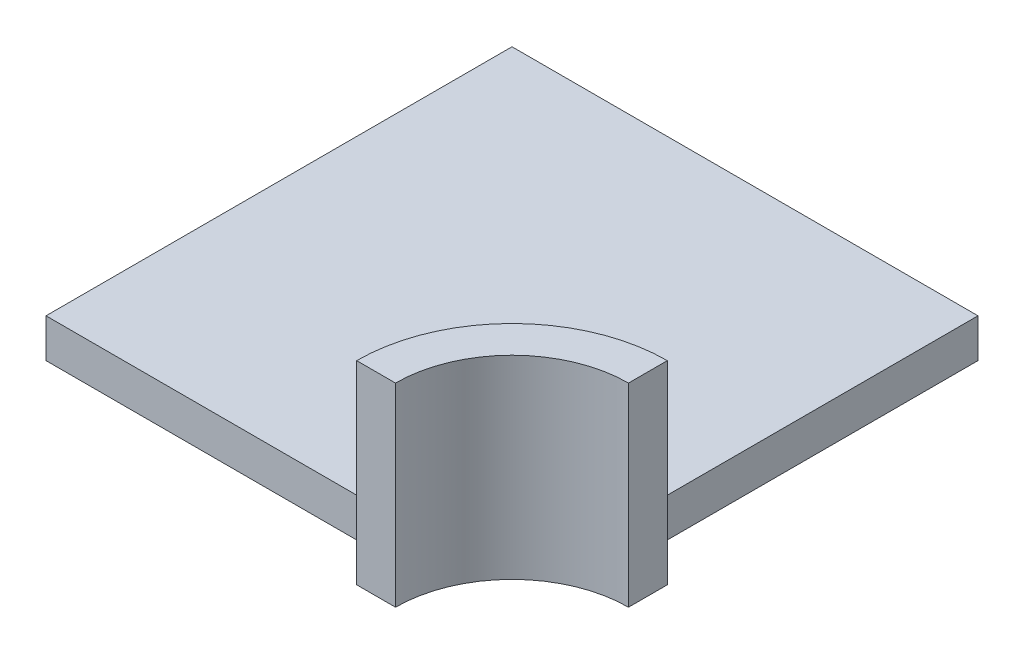
ISO-10303-21;
HEADER;
FILE_DESCRIPTION(('STEP AP214'),'2;1');
FILE_NAME('part.step','',(''),(''),'','','');
FILE_SCHEMA(('AUTOMOTIVE_DESIGN { 1 0 10303 214 1 1 1 1 }'));
ENDSEC;
DATA;
#1=APPLICATION_CONTEXT('core data for automotive mechanical design processes');
#2=APPLICATION_PROTOCOL_DEFINITION('international standard','automotive_design',2000,#1);
#3=PRODUCT_CONTEXT('',#1,'mechanical');
#4=PRODUCT('Part','Part','',(#3));
#5=PRODUCT_RELATED_PRODUCT_CATEGORY('part','',(#4));
#6=PRODUCT_DEFINITION_FORMATION('','',#4);
#7=PRODUCT_DEFINITION_CONTEXT('part definition',#1,'design');
#8=PRODUCT_DEFINITION('design','',#6,#7);
#9=PRODUCT_DEFINITION_SHAPE('','',#8);
#10=(LENGTH_UNIT() NAMED_UNIT(*) SI_UNIT(.MILLI.,.METRE.));
#11=(NAMED_UNIT(*) PLANE_ANGLE_UNIT() SI_UNIT($,.RADIAN.));
#12=(NAMED_UNIT(*) SI_UNIT($,.STERADIAN.) SOLID_ANGLE_UNIT());
#13=UNCERTAINTY_MEASURE_WITH_UNIT(LENGTH_MEASURE(1.E-05),#10,'distance_accuracy_value','');
#14=(GEOMETRIC_REPRESENTATION_CONTEXT(3) GLOBAL_UNCERTAINTY_ASSIGNED_CONTEXT((#13)) GLOBAL_UNIT_ASSIGNED_CONTEXT((#10,
#11,#12)) REPRESENTATION_CONTEXT('',''));
#15=CARTESIAN_POINT('',(0.,0.,0.));
#16=DIRECTION('',(0.,0.,1.));
#17=DIRECTION('',(1.,0.,0.));
#18=AXIS2_PLACEMENT_3D('',#15,#16,#17);
#19=CARTESIAN_POINT('',(1.25,-0.05,1.));
#20=DIRECTION('',(0.,1.,0.));
#21=DIRECTION('',(0.,0.,1.));
#22=AXIS2_PLACEMENT_3D('',#19,#20,#21);
#23=CYLINDRICAL_SURFACE('',#22,0.2);
#24=DIRECTION('',(0.,1.,0.));
#25=VECTOR('',#24,1.);
#26=CARTESIAN_POINT('',(1.05635083268963,-0.898528137423858,0.95));
#27=LINE('',#26,#25);
#28=CARTESIAN_POINT('',(1.05635083268963,-0.05,0.95));
#29=VERTEX_POINT('',#28);
#30=CARTESIAN_POINT('',(1.05635083268963,0.,0.95));
#31=VERTEX_POINT('',#30);
#32=EDGE_CURVE('E11',#29,#31,#27,.T.);
#33=ORIENTED_EDGE('',*,*,#32,.F.);
#34=CARTESIAN_POINT('',(1.25,-0.05,1.));
#35=DIRECTION('',(0.,-1.,0.));
#36=DIRECTION('',(0.,0.,-1.));
#37=AXIS2_PLACEMENT_3D('',#34,#35,#36);
#38=CIRCLE('',#37,0.2);
#39=CARTESIAN_POINT('',(1.05,-0.05,1.));
#40=VERTEX_POINT('',#39);
#41=EDGE_CURVE('E24',#40,#29,#38,.T.);
#42=ORIENTED_EDGE('',*,*,#41,.F.);
#43=DIRECTION('',(0.,1.,0.));
#44=VECTOR('',#43,1.);
#45=CARTESIAN_POINT('',(1.05,-0.05,1.));
#46=LINE('',#45,#44);
#47=CARTESIAN_POINT('',(1.05,0.2,1.));
#48=VERTEX_POINT('',#47);
#49=EDGE_CURVE('E158',#40,#48,#46,.T.);
#50=ORIENTED_EDGE('',*,*,#49,.T.);
#51=CARTESIAN_POINT('',(1.25,0.2,1.));
#52=DIRECTION('',(0.,-1.,0.));
#53=DIRECTION('',(0.,0.,-1.));
#54=AXIS2_PLACEMENT_3D('',#51,#52,#53);
#55=CIRCLE('',#54,0.2);
#56=CARTESIAN_POINT('',(1.25,0.2,0.8));
#57=VERTEX_POINT('',#56);
#58=EDGE_CURVE('E156',#48,#57,#55,.T.);
#59=ORIENTED_EDGE('',*,*,#58,.T.);
#60=DIRECTION('',(0.,1.,0.));
#61=VECTOR('',#60,1.);
#62=CARTESIAN_POINT('',(1.25,-0.05,0.8));
#63=LINE('',#62,#61);
#64=CARTESIAN_POINT('',(1.25,-0.05,0.8));
#65=VERTEX_POINT('',#64);
#66=EDGE_CURVE('E153',#65,#57,#63,.T.);
#67=ORIENTED_EDGE('',*,*,#66,.F.);
#68=CARTESIAN_POINT('',(1.25,-0.05,1.));
#69=DIRECTION('',(0.,-1.,0.));
#70=DIRECTION('',(0.,0.,-1.));
#71=AXIS2_PLACEMENT_3D('',#68,#69,#70);
#72=CIRCLE('',#71,0.2);
#73=CARTESIAN_POINT('',(1.2,-0.05,0.806350832689629));
#74=VERTEX_POINT('',#73);
#75=EDGE_CURVE('E150',#74,#65,#72,.T.);
#76=ORIENTED_EDGE('',*,*,#75,.F.);
#77=DIRECTION('',(0.,1.,0.));
#78=VECTOR('',#77,1.);
#79=CARTESIAN_POINT('',(1.2,-0.898528137423858,0.806350832689629));
#80=LINE('',#79,#78);
#81=CARTESIAN_POINT('',(1.2,0.,0.806350832689629));
#82=VERTEX_POINT('',#81);
#83=EDGE_CURVE('E148',#74,#82,#80,.T.);
#84=ORIENTED_EDGE('',*,*,#83,.T.);
#85=CARTESIAN_POINT('',(1.25,0.,1.));
#86=DIRECTION('',(0.,1.,0.));
#87=DIRECTION('',(0.,0.,-1.));
#88=AXIS2_PLACEMENT_3D('',#85,#86,#87);
#89=CIRCLE('',#88,0.2);
#90=EDGE_CURVE('E107',#82,#31,#89,.T.);
#91=ORIENTED_EDGE('',*,*,#90,.T.);
#92=EDGE_LOOP('',(#33,#42,#50,#59,#67,#76,#84,#91));
#93=FACE_BOUND('',#92,.T.);
#94=ADVANCED_FACE('F17',(#93),#23,.T.);
#95=CARTESIAN_POINT('',(1.25,-0.05,1.));
#96=DIRECTION('',(0.,1.,0.));
#97=DIRECTION('',(0.,0.,1.));
#98=AXIS2_PLACEMENT_3D('',#95,#96,#97);
#99=CYLINDRICAL_SURFACE('',#98,0.15);
#100=DIRECTION('',(0.,1.,0.));
#101=VECTOR('',#100,1.);
#102=CARTESIAN_POINT('',(1.25,-0.05,0.85));
#103=LINE('',#102,#101);
#104=CARTESIAN_POINT('',(1.25,-0.05,0.85));
#105=VERTEX_POINT('',#104);
#106=CARTESIAN_POINT('',(1.25,0.2,0.85));
#107=VERTEX_POINT('',#106);
#108=EDGE_CURVE('E144',#105,#107,#103,.T.);
#109=ORIENTED_EDGE('',*,*,#108,.T.);
#110=CARTESIAN_POINT('',(1.25,0.2,1.));
#111=DIRECTION('',(0.,1.,0.));
#112=DIRECTION('',(0.,0.,-1.));
#113=AXIS2_PLACEMENT_3D('',#110,#111,#112);
#114=CIRCLE('',#113,0.15);
#115=CARTESIAN_POINT('',(1.1,0.2,1.));
#116=VERTEX_POINT('',#115);
#117=EDGE_CURVE('E141',#107,#116,#114,.T.);
#118=ORIENTED_EDGE('',*,*,#117,.T.);
#119=DIRECTION('',(0.,1.,0.));
#120=VECTOR('',#119,1.);
#121=CARTESIAN_POINT('',(1.1,-0.05,1.));
#122=LINE('',#121,#120);
#123=CARTESIAN_POINT('',(1.1,-0.05,1.));
#124=VERTEX_POINT('',#123);
#125=EDGE_CURVE('E139',#124,#116,#122,.T.);
#126=ORIENTED_EDGE('',*,*,#125,.F.);
#127=CARTESIAN_POINT('',(1.25,-0.05,1.));
#128=DIRECTION('',(0.,1.,0.));
#129=DIRECTION('',(0.,0.,-1.));
#130=AXIS2_PLACEMENT_3D('',#127,#128,#129);
#131=CIRCLE('',#130,0.15);
#132=EDGE_CURVE('E137',#105,#124,#131,.T.);
#133=ORIENTED_EDGE('',*,*,#132,.F.);
#134=EDGE_LOOP('',(#109,#118,#126,#133));
#135=FACE_BOUND('',#134,.T.);
#136=ADVANCED_FACE('F174',(#135),#99,.F.);
#137=CARTESIAN_POINT('',(1.05,-0.05,1.));
#138=DIRECTION('',(0.,0.,-1.));
#139=DIRECTION('',(-1.,0.,0.));
#140=AXIS2_PLACEMENT_3D('',#137,#138,#139);
#141=PLANE('',#140);
#142=ORIENTED_EDGE('',*,*,#125,.T.);
#143=DIRECTION('',(-1.,0.,0.));
#144=VECTOR('',#143,1.);
#145=CARTESIAN_POINT('',(1.05,0.2,1.));
#146=LINE('',#145,#144);
#147=EDGE_CURVE('E134',#116,#48,#146,.T.);
#148=ORIENTED_EDGE('',*,*,#147,.T.);
#149=ORIENTED_EDGE('',*,*,#49,.F.);
#150=DIRECTION('',(-1.,0.,0.));
#151=VECTOR('',#150,1.);
#152=CARTESIAN_POINT('',(1.05,-0.05,1.));
#153=LINE('',#152,#151);
#154=EDGE_CURVE('E131',#124,#40,#153,.T.);
#155=ORIENTED_EDGE('',*,*,#154,.F.);
#156=EDGE_LOOP('',(#142,#148,#149,#155));
#157=FACE_BOUND('',#156,.T.);
#158=ADVANCED_FACE('F178',(#157),#141,.F.);
#159=CARTESIAN_POINT('',(1.25,-0.05,0.85));
#160=DIRECTION('',(-1.,0.,0.));
#161=DIRECTION('',(0.,0.,1.));
#162=AXIS2_PLACEMENT_3D('',#159,#160,#161);
#163=PLANE('',#162);
#164=ORIENTED_EDGE('',*,*,#66,.T.);
#165=DIRECTION('',(0.,0.,1.));
#166=VECTOR('',#165,1.);
#167=CARTESIAN_POINT('',(1.25,0.2,0.85));
#168=LINE('',#167,#166);
#169=EDGE_CURVE('E128',#57,#107,#168,.T.);
#170=ORIENTED_EDGE('',*,*,#169,.T.);
#171=ORIENTED_EDGE('',*,*,#108,.F.);
#172=DIRECTION('',(0.,0.,1.));
#173=VECTOR('',#172,1.);
#174=CARTESIAN_POINT('',(1.25,-0.05,0.85));
#175=LINE('',#174,#173);
#176=EDGE_CURVE('E125',#65,#105,#175,.T.);
#177=ORIENTED_EDGE('',*,*,#176,.F.);
#178=EDGE_LOOP('',(#164,#170,#171,#177));
#179=FACE_BOUND('',#178,.T.);
#180=ADVANCED_FACE('F171',(#179),#163,.F.);
#181=CARTESIAN_POINT('',(1.25,-0.05,1.));
#182=DIRECTION('',(0.,-1.,0.));
#183=DIRECTION('',(0.,0.,-1.));
#184=AXIS2_PLACEMENT_3D('',#181,#182,#183);
#185=PLANE('',#184);
#186=ORIENTED_EDGE('',*,*,#132,.T.);
#187=ORIENTED_EDGE('',*,*,#154,.T.);
#188=ORIENTED_EDGE('',*,*,#41,.T.);
#189=DIRECTION('',(-1.,0.,0.));
#190=VECTOR('',#189,1.);
#191=CARTESIAN_POINT('',(1.05635083268963,-0.05,0.95));
#192=LINE('',#191,#190);
#193=CARTESIAN_POINT('',(0.6,-0.05,0.95));
#194=VERTEX_POINT('',#193);
#195=EDGE_CURVE('E123',#29,#194,#192,.T.);
#196=ORIENTED_EDGE('',*,*,#195,.T.);
#197=DIRECTION('',(0.,0.,-1.));
#198=VECTOR('',#197,1.);
#199=CARTESIAN_POINT('',(0.6,-0.05,0.95));
#200=LINE('',#199,#198);
#201=CARTESIAN_POINT('',(0.6,-0.05,0.35));
#202=VERTEX_POINT('',#201);
#203=EDGE_CURVE('E121',#194,#202,#200,.T.);
#204=ORIENTED_EDGE('',*,*,#203,.T.);
#205=DIRECTION('',(1.,0.,0.));
#206=VECTOR('',#205,1.);
#207=CARTESIAN_POINT('',(0.6,-0.05,0.35));
#208=LINE('',#207,#206);
#209=CARTESIAN_POINT('',(1.2,-0.05,0.35));
#210=VERTEX_POINT('',#209);
#211=EDGE_CURVE('E119',#202,#210,#208,.T.);
#212=ORIENTED_EDGE('',*,*,#211,.T.);
#213=DIRECTION('',(0.,0.,1.));
#214=VECTOR('',#213,1.);
#215=CARTESIAN_POINT('',(1.2,-0.05,0.35));
#216=LINE('',#215,#214);
#217=EDGE_CURVE('E102',#210,#74,#216,.T.);
#218=ORIENTED_EDGE('',*,*,#217,.T.);
#219=ORIENTED_EDGE('',*,*,#75,.T.);
#220=ORIENTED_EDGE('',*,*,#176,.T.);
#221=EDGE_LOOP('',(#186,#187,#188,#196,#204,#212,#218,#219,#220));
#222=FACE_BOUND('',#221,.T.);
#223=ADVANCED_FACE('F160',(#222),#185,.T.);
#224=CARTESIAN_POINT('',(1.25,0.2,1.));
#225=DIRECTION('',(0.,-1.,0.));
#226=DIRECTION('',(0.,0.,-1.));
#227=AXIS2_PLACEMENT_3D('',#224,#225,#226);
#228=PLANE('',#227);
#229=ORIENTED_EDGE('',*,*,#117,.F.);
#230=ORIENTED_EDGE('',*,*,#169,.F.);
#231=ORIENTED_EDGE('',*,*,#58,.F.);
#232=ORIENTED_EDGE('',*,*,#147,.F.);
#233=EDGE_LOOP('',(#229,#230,#231,#232));
#234=FACE_BOUND('',#233,.T.);
#235=ADVANCED_FACE('F181',(#234),#228,.F.);
#236=CARTESIAN_POINT('',(1.05635083268963,-0.898528137423858,0.95));
#237=DIRECTION('',(0.,0.,-1.));
#238=DIRECTION('',(-1.,0.,0.));
#239=AXIS2_PLACEMENT_3D('',#236,#237,#238);
#240=PLANE('',#239);
#241=ORIENTED_EDGE('',*,*,#195,.F.);
#242=ORIENTED_EDGE('',*,*,#32,.T.);
#243=DIRECTION('',(-1.,0.,0.));
#244=VECTOR('',#243,1.);
#245=CARTESIAN_POINT('',(1.05635083268963,0.,0.95));
#246=LINE('',#245,#244);
#247=CARTESIAN_POINT('',(0.6,0.,0.95));
#248=VERTEX_POINT('',#247);
#249=EDGE_CURVE('E116',#31,#248,#246,.T.);
#250=ORIENTED_EDGE('',*,*,#249,.T.);
#251=DIRECTION('',(0.,1.,0.));
#252=VECTOR('',#251,1.);
#253=CARTESIAN_POINT('',(0.6,-0.898528137423858,0.95));
#254=LINE('',#253,#252);
#255=EDGE_CURVE('E113',#194,#248,#254,.T.);
#256=ORIENTED_EDGE('',*,*,#255,.F.);
#257=EDGE_LOOP('',(#241,#242,#250,#256));
#258=FACE_BOUND('',#257,.T.);
#259=ADVANCED_FACE('F165',(#258),#240,.F.);
#260=CARTESIAN_POINT('',(0.6,-0.898528137423858,0.95));
#261=DIRECTION('',(1.,0.,0.));
#262=DIRECTION('',(0.,0.,-1.));
#263=AXIS2_PLACEMENT_3D('',#260,#261,#262);
#264=PLANE('',#263);
#265=ORIENTED_EDGE('',*,*,#203,.F.);
#266=ORIENTED_EDGE('',*,*,#255,.T.);
#267=DIRECTION('',(0.,0.,-1.));
#268=VECTOR('',#267,1.);
#269=CARTESIAN_POINT('',(0.6,0.,0.95));
#270=LINE('',#269,#268);
#271=CARTESIAN_POINT('',(0.6,0.,0.35));
#272=VERTEX_POINT('',#271);
#273=EDGE_CURVE('E111',#248,#272,#270,.T.);
#274=ORIENTED_EDGE('',*,*,#273,.T.);
#275=DIRECTION('',(0.,1.,0.));
#276=VECTOR('',#275,1.);
#277=CARTESIAN_POINT('',(0.6,-0.898528137423858,0.35));
#278=LINE('',#277,#276);
#279=EDGE_CURVE('E90',#202,#272,#278,.T.);
#280=ORIENTED_EDGE('',*,*,#279,.F.);
#281=EDGE_LOOP('',(#265,#266,#274,#280));
#282=FACE_BOUND('',#281,.T.);
#283=ADVANCED_FACE('F167',(#282),#264,.F.);
#284=CARTESIAN_POINT('',(0.6,-0.898528137423858,0.35));
#285=DIRECTION('',(0.,0.,1.));
#286=DIRECTION('',(1.,0.,0.));
#287=AXIS2_PLACEMENT_3D('',#284,#285,#286);
#288=PLANE('',#287);
#289=ORIENTED_EDGE('',*,*,#211,.F.);
#290=ORIENTED_EDGE('',*,*,#279,.T.);
#291=DIRECTION('',(1.,0.,0.));
#292=VECTOR('',#291,1.);
#293=CARTESIAN_POINT('',(0.6,0.,0.35));
#294=LINE('',#293,#292);
#295=CARTESIAN_POINT('',(1.2,0.,0.35));
#296=VERTEX_POINT('',#295);
#297=EDGE_CURVE('E84',#272,#296,#294,.T.);
#298=ORIENTED_EDGE('',*,*,#297,.T.);
#299=DIRECTION('',(0.,1.,0.));
#300=VECTOR('',#299,1.);
#301=CARTESIAN_POINT('',(1.2,-0.898528137423858,0.35));
#302=LINE('',#301,#300);
#303=EDGE_CURVE('E88',#210,#296,#302,.T.);
#304=ORIENTED_EDGE('',*,*,#303,.F.);
#305=EDGE_LOOP('',(#289,#290,#298,#304));
#306=FACE_BOUND('',#305,.T.);
#307=ADVANCED_FACE('F87',(#306),#288,.F.);
#308=CARTESIAN_POINT('',(1.2,-0.898528137423858,0.35));
#309=DIRECTION('',(-1.,0.,0.));
#310=DIRECTION('',(0.,0.,1.));
#311=AXIS2_PLACEMENT_3D('',#308,#309,#310);
#312=PLANE('',#311);
#313=ORIENTED_EDGE('',*,*,#217,.F.);
#314=ORIENTED_EDGE('',*,*,#303,.T.);
#315=DIRECTION('',(0.,0.,1.));
#316=VECTOR('',#315,1.);
#317=CARTESIAN_POINT('',(1.2,0.,0.35));
#318=LINE('',#317,#316);
#319=EDGE_CURVE('E100',#296,#82,#318,.T.);
#320=ORIENTED_EDGE('',*,*,#319,.T.);
#321=ORIENTED_EDGE('',*,*,#83,.F.);
#322=EDGE_LOOP('',(#313,#314,#320,#321));
#323=FACE_BOUND('',#322,.T.);
#324=ADVANCED_FACE('F98',(#323),#312,.F.);
#325=CARTESIAN_POINT('',(1.25,0.,1.));
#326=DIRECTION('',(0.,-1.,0.));
#327=DIRECTION('',(0.,0.,-1.));
#328=AXIS2_PLACEMENT_3D('',#325,#326,#327);
#329=PLANE('',#328);
#330=ORIENTED_EDGE('',*,*,#90,.F.);
#331=ORIENTED_EDGE('',*,*,#319,.F.);
#332=ORIENTED_EDGE('',*,*,#297,.F.);
#333=ORIENTED_EDGE('',*,*,#273,.F.);
#334=ORIENTED_EDGE('',*,*,#249,.F.);
#335=EDGE_LOOP('',(#330,#331,#332,#333,#334));
#336=FACE_BOUND('',#335,.T.);
#337=ADVANCED_FACE('F105',(#336),#329,.F.);
#338=CLOSED_SHELL('',(#94,#136,#158,#180,#223,#235,#259,#283,#307,#324,#337));
#339=MANIFOLD_SOLID_BREP('B1',#338);
#340=ADVANCED_BREP_SHAPE_REPRESENTATION('',(#18,#339),#14);
#341=SHAPE_DEFINITION_REPRESENTATION(#9,#340);
ENDSEC;
END-ISO-10303-21;
